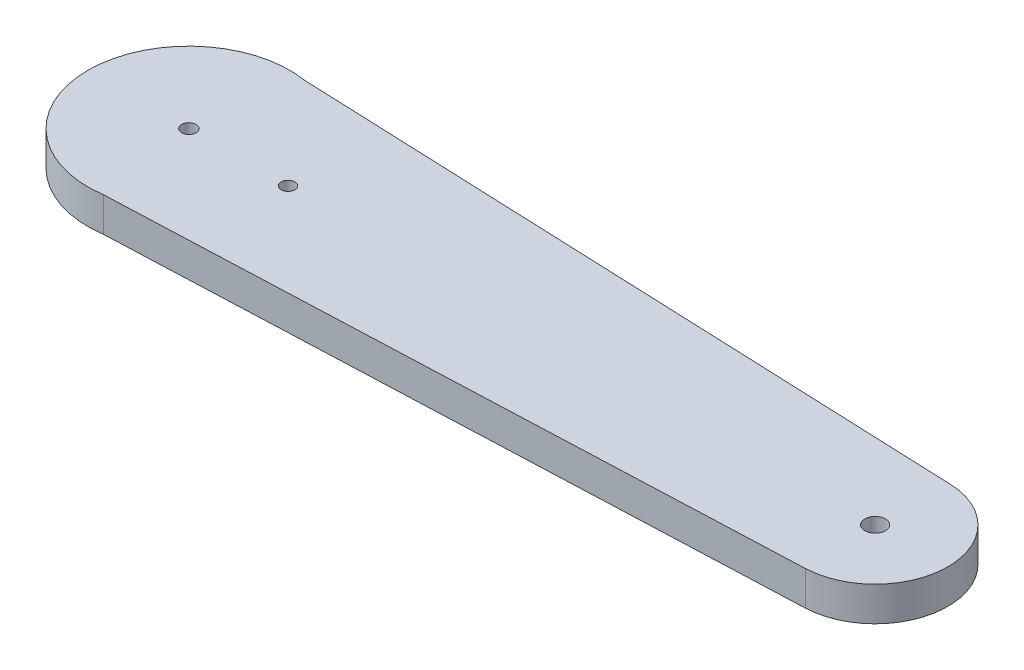
ISO-10303-21;
HEADER;
FILE_DESCRIPTION(('STEP AP214'),'2;1');
FILE_NAME('part.step','',(''),(''),'','','');
FILE_SCHEMA(('AUTOMOTIVE_DESIGN { 1 0 10303 214 1 1 1 1 }'));
ENDSEC;
DATA;
#1=APPLICATION_CONTEXT('core data for automotive mechanical design processes');
#2=APPLICATION_PROTOCOL_DEFINITION('international standard','automotive_design',2000,#1);
#3=PRODUCT_CONTEXT('',#1,'mechanical');
#4=PRODUCT('Part','Part','',(#3));
#5=PRODUCT_RELATED_PRODUCT_CATEGORY('part','',(#4));
#6=PRODUCT_DEFINITION_FORMATION('','',#4);
#7=PRODUCT_DEFINITION_CONTEXT('part definition',#1,'design');
#8=PRODUCT_DEFINITION('design','',#6,#7);
#9=PRODUCT_DEFINITION_SHAPE('','',#8);
#10=(LENGTH_UNIT() NAMED_UNIT(*) SI_UNIT(.MILLI.,.METRE.));
#11=(NAMED_UNIT(*) PLANE_ANGLE_UNIT() SI_UNIT($,.RADIAN.));
#12=(NAMED_UNIT(*) SI_UNIT($,.STERADIAN.) SOLID_ANGLE_UNIT());
#13=UNCERTAINTY_MEASURE_WITH_UNIT(LENGTH_MEASURE(1.E-05),#10,'distance_accuracy_value','');
#14=(GEOMETRIC_REPRESENTATION_CONTEXT(3) GLOBAL_UNCERTAINTY_ASSIGNED_CONTEXT((#13)) GLOBAL_UNIT_ASSIGNED_CONTEXT((#10,
#11,#12)) REPRESENTATION_CONTEXT('',''));
#15=CARTESIAN_POINT('',(0.,0.,0.));
#16=DIRECTION('',(0.,0.,1.));
#17=DIRECTION('',(1.,0.,0.));
#18=AXIS2_PLACEMENT_3D('',#15,#16,#17);
#19=CARTESIAN_POINT('',(-52.7218919539476,5.,0.));
#20=DIRECTION('',(0.,1.,0.));
#21=DIRECTION('',(0.,0.,1.));
#22=AXIS2_PLACEMENT_3D('',#19,#20,#21);
#23=PLANE('',#22);
#24=CARTESIAN_POINT('',(-38.2718919539476,5.,0.));
#25=DIRECTION('',(0.,1.,0.));
#26=DIRECTION('',(0.,0.,1.));
#27=AXIS2_PLACEMENT_3D('',#24,#25,#26);
#28=CIRCLE('',#27,0.999999999999998);
#29=CARTESIAN_POINT('',(-38.2718919539476,5.,0.999999999999998));
#30=VERTEX_POINT('',#29);
#31=EDGE_CURVE('E144',#30,#30,#28,.T.);
#32=ORIENTED_EDGE('',*,*,#31,.F.);
#33=EDGE_LOOP('',(#32));
#34=FACE_BOUND('',#33,.T.);
#35=CARTESIAN_POINT('',(-52.7218919539476,5.,0.));
#36=DIRECTION('',(0.,1.,0.));
#37=DIRECTION('',(0.,0.,1.));
#38=AXIS2_PLACEMENT_3D('',#35,#36,#37);
#39=CIRCLE('',#38,1.05);
#40=CARTESIAN_POINT('',(-52.7218919539476,5.,1.05));
#41=VERTEX_POINT('',#40);
#42=EDGE_CURVE('E114',#41,#41,#39,.T.);
#43=ORIENTED_EDGE('',*,*,#42,.F.);
#44=EDGE_LOOP('',(#43));
#45=FACE_BOUND('',#44,.T.);
#46=CARTESIAN_POINT('',(-52.7218919539476,5.,0.));
#47=DIRECTION('',(0.,1.,0.));
#48=DIRECTION('',(0.,0.,1.));
#49=AXIS2_PLACEMENT_3D('',#46,#47,#48);
#50=CIRCLE('',#49,14.72);
#51=CARTESIAN_POINT('',(-50.3488427591689,5.,-14.5274580542902));
#52=VERTEX_POINT('',#51);
#53=CARTESIAN_POINT('',(-50.5835852424027,5.,14.5638609031864));
#54=VERTEX_POINT('',#53);
#55=EDGE_CURVE('E94',#52,#54,#50,.T.);
#56=ORIENTED_EDGE('',*,*,#55,.T.);
#57=DIRECTION('',(0.999184260805067,0.,-0.0403833252646607));
#58=VECTOR('',#57,1.);
#59=CARTESIAN_POINT('',(-50.5835852424027,5.,14.5638609031864));
#60=LINE('',#59,#58);
#61=CARTESIAN_POINT('',(47.7061712938578,5.,10.5913531645337));
#62=VERTEX_POINT('',#61);
#63=EDGE_CURVE('E89',#54,#62,#60,.T.);
#64=ORIENTED_EDGE('',*,*,#63,.T.);
#65=CARTESIAN_POINT('',(47.2781080460524,5.,0.));
#66=DIRECTION('',(0.,1.,0.));
#67=DIRECTION('',(0.,0.,1.));
#68=AXIS2_PLACEMENT_3D('',#65,#66,#67);
#69=CIRCLE('',#68,10.6);
#70=CARTESIAN_POINT('',(47.6312452465184,5.,-10.594116013979));
#71=VERTEX_POINT('',#70);
#72=EDGE_CURVE('E92',#62,#71,#69,.T.);
#73=ORIENTED_EDGE('',*,*,#72,.T.);
#74=DIRECTION('',(-0.999195190213286,0.,-0.0401119914070138));
#75=VECTOR('',#74,1.);
#76=CARTESIAN_POINT('',(-50.3488427591689,5.,-14.5274580542902));
#77=LINE('',#76,#75);
#78=EDGE_CURVE('E59',#71,#52,#77,.T.);
#79=ORIENTED_EDGE('',*,*,#78,.T.);
#80=EDGE_LOOP('',(#56,#64,#73,#79));
#81=FACE_BOUND('',#80,.T.);
#82=CARTESIAN_POINT('',(47.2781080460524,5.,0.));
#83=DIRECTION('',(0.,1.,0.));
#84=DIRECTION('',(0.,0.,1.));
#85=AXIS2_PLACEMENT_3D('',#82,#83,#84);
#86=CIRCLE('',#85,1.5);
#87=CARTESIAN_POINT('',(47.2781080460524,5.,1.5));
#88=VERTEX_POINT('',#87);
#89=EDGE_CURVE('E136',#88,#88,#86,.T.);
#90=ORIENTED_EDGE('',*,*,#89,.F.);
#91=EDGE_LOOP('',(#90));
#92=FACE_BOUND('',#91,.T.);
#93=ADVANCED_FACE('F41',(#34,#45,#81,#92),#23,.T.);
#94=CARTESIAN_POINT('',(-52.7218919539476,0.,0.));
#95=DIRECTION('',(0.,1.,0.));
#96=DIRECTION('',(0.,0.,1.));
#97=AXIS2_PLACEMENT_3D('',#94,#95,#96);
#98=PLANE('',#97);
#99=CARTESIAN_POINT('',(-38.2718919539476,0.,0.));
#100=DIRECTION('',(0.,1.,0.));
#101=DIRECTION('',(0.,0.,1.));
#102=AXIS2_PLACEMENT_3D('',#99,#100,#101);
#103=CIRCLE('',#102,0.999999999999998);
#104=CARTESIAN_POINT('',(-38.2718919539476,0.,0.999999999999998));
#105=VERTEX_POINT('',#104);
#106=EDGE_CURVE('E151',#105,#105,#103,.T.);
#107=ORIENTED_EDGE('',*,*,#106,.T.);
#108=EDGE_LOOP('',(#107));
#109=FACE_BOUND('',#108,.T.);
#110=CARTESIAN_POINT('',(-52.7218919539476,0.,0.));
#111=DIRECTION('',(0.,1.,0.));
#112=DIRECTION('',(0.,0.,1.));
#113=AXIS2_PLACEMENT_3D('',#110,#111,#112);
#114=CIRCLE('',#113,14.72);
#115=CARTESIAN_POINT('',(-50.3488427591689,0.,-14.5274580542902));
#116=VERTEX_POINT('',#115);
#117=CARTESIAN_POINT('',(-50.5835852424027,0.,14.5638609031864));
#118=VERTEX_POINT('',#117);
#119=EDGE_CURVE('E110',#116,#118,#114,.T.);
#120=ORIENTED_EDGE('',*,*,#119,.F.);
#121=DIRECTION('',(-0.999195190213286,0.,-0.0401119914070138));
#122=VECTOR('',#121,1.);
#123=CARTESIAN_POINT('',(-50.3488427591689,0.,-14.5274580542902));
#124=LINE('',#123,#122);
#125=CARTESIAN_POINT('',(47.6312452465184,0.,-10.594116013979));
#126=VERTEX_POINT('',#125);
#127=EDGE_CURVE('E82',#126,#116,#124,.T.);
#128=ORIENTED_EDGE('',*,*,#127,.F.);
#129=CARTESIAN_POINT('',(47.2781080460524,0.,0.));
#130=DIRECTION('',(0.,1.,0.));
#131=DIRECTION('',(0.,0.,1.));
#132=AXIS2_PLACEMENT_3D('',#129,#130,#131);
#133=CIRCLE('',#132,10.6);
#134=CARTESIAN_POINT('',(47.7061712938578,0.,10.5913531645337));
#135=VERTEX_POINT('',#134);
#136=EDGE_CURVE('E76',#135,#126,#133,.T.);
#137=ORIENTED_EDGE('',*,*,#136,.F.);
#138=DIRECTION('',(0.999184260805067,0.,-0.0403833252646607));
#139=VECTOR('',#138,1.);
#140=CARTESIAN_POINT('',(-50.5835852424027,0.,14.5638609031864));
#141=LINE('',#140,#139);
#142=EDGE_CURVE('E99',#118,#135,#141,.T.);
#143=ORIENTED_EDGE('',*,*,#142,.F.);
#144=EDGE_LOOP('',(#120,#128,#137,#143));
#145=FACE_BOUND('',#144,.T.);
#146=CARTESIAN_POINT('',(-52.7218919539476,0.,0.));
#147=DIRECTION('',(0.,1.,0.));
#148=DIRECTION('',(0.,0.,1.));
#149=AXIS2_PLACEMENT_3D('',#146,#147,#148);
#150=CIRCLE('',#149,1.05);
#151=CARTESIAN_POINT('',(-52.7218919539476,0.,1.05));
#152=VERTEX_POINT('',#151);
#153=EDGE_CURVE('E132',#152,#152,#150,.T.);
#154=ORIENTED_EDGE('',*,*,#153,.T.);
#155=EDGE_LOOP('',(#154));
#156=FACE_BOUND('',#155,.T.);
#157=CARTESIAN_POINT('',(47.2781080460524,0.,0.));
#158=DIRECTION('',(0.,1.,0.));
#159=DIRECTION('',(0.,0.,1.));
#160=AXIS2_PLACEMENT_3D('',#157,#158,#159);
#161=CIRCLE('',#160,1.5);
#162=CARTESIAN_POINT('',(47.2781080460524,0.,1.5));
#163=VERTEX_POINT('',#162);
#164=EDGE_CURVE('E140',#163,#163,#161,.T.);
#165=ORIENTED_EDGE('',*,*,#164,.T.);
#166=EDGE_LOOP('',(#165));
#167=FACE_BOUND('',#166,.T.);
#168=ADVANCED_FACE('F127',(#109,#145,#156,#167),#98,.F.);
#169=CARTESIAN_POINT('',(-52.7218919539476,5.,0.));
#170=DIRECTION('',(0.,-1.,0.));
#171=DIRECTION('',(0.,0.,-1.));
#172=AXIS2_PLACEMENT_3D('',#169,#170,#171);
#173=CYLINDRICAL_SURFACE('',#172,14.72);
#174=ORIENTED_EDGE('',*,*,#119,.T.);
#175=DIRECTION('',(0.,-1.,0.));
#176=VECTOR('',#175,1.);
#177=CARTESIAN_POINT('',(-50.5835852424027,5.,14.5638609031864));
#178=LINE('',#177,#176);
#179=EDGE_CURVE('E11',#54,#118,#178,.T.);
#180=ORIENTED_EDGE('',*,*,#179,.F.);
#181=ORIENTED_EDGE('',*,*,#55,.F.);
#182=DIRECTION('',(0.,-1.,0.));
#183=VECTOR('',#182,1.);
#184=CARTESIAN_POINT('',(-50.3488427591689,5.,-14.5274580542902));
#185=LINE('',#184,#183);
#186=EDGE_CURVE('E106',#52,#116,#185,.T.);
#187=ORIENTED_EDGE('',*,*,#186,.T.);
#188=EDGE_LOOP('',(#174,#180,#181,#187));
#189=FACE_BOUND('',#188,.T.);
#190=ADVANCED_FACE('F43',(#189),#173,.T.);
#191=CARTESIAN_POINT('',(-50.5835852424027,5.,14.5638609031864));
#192=DIRECTION('',(-0.0403833252646607,0.,-0.999184260805067));
#193=DIRECTION('',(-0.999184260805067,0.,0.0403833252646607));
#194=AXIS2_PLACEMENT_3D('',#191,#192,#193);
#195=PLANE('',#194);
#196=ORIENTED_EDGE('',*,*,#142,.T.);
#197=DIRECTION('',(0.,-1.,0.));
#198=VECTOR('',#197,1.);
#199=CARTESIAN_POINT('',(47.7061712938578,5.,10.5913531645337));
#200=LINE('',#199,#198);
#201=EDGE_CURVE('E51',#62,#135,#200,.T.);
#202=ORIENTED_EDGE('',*,*,#201,.F.);
#203=ORIENTED_EDGE('',*,*,#63,.F.);
#204=ORIENTED_EDGE('',*,*,#179,.T.);
#205=EDGE_LOOP('',(#196,#202,#203,#204));
#206=FACE_BOUND('',#205,.T.);
#207=ADVANCED_FACE('F98',(#206),#195,.F.);
#208=CARTESIAN_POINT('',(47.2781080460524,5.,0.));
#209=DIRECTION('',(0.,-1.,0.));
#210=DIRECTION('',(0.,0.,-1.));
#211=AXIS2_PLACEMENT_3D('',#208,#209,#210);
#212=CYLINDRICAL_SURFACE('',#211,10.6);
#213=ORIENTED_EDGE('',*,*,#136,.T.);
#214=DIRECTION('',(0.,-1.,0.));
#215=VECTOR('',#214,1.);
#216=CARTESIAN_POINT('',(47.6312452465184,5.,-10.594116013979));
#217=LINE('',#216,#215);
#218=EDGE_CURVE('E101',#71,#126,#217,.T.);
#219=ORIENTED_EDGE('',*,*,#218,.F.);
#220=ORIENTED_EDGE('',*,*,#72,.F.);
#221=ORIENTED_EDGE('',*,*,#201,.T.);
#222=EDGE_LOOP('',(#213,#219,#220,#221));
#223=FACE_BOUND('',#222,.T.);
#224=ADVANCED_FACE('F102',(#223),#212,.T.);
#225=CARTESIAN_POINT('',(-50.3488427591689,5.,-14.5274580542902));
#226=DIRECTION('',(-0.0401119914070138,0.,0.999195190213286));
#227=DIRECTION('',(0.999195190213286,0.,0.0401119914070138));
#228=AXIS2_PLACEMENT_3D('',#225,#226,#227);
#229=PLANE('',#228);
#230=ORIENTED_EDGE('',*,*,#127,.T.);
#231=ORIENTED_EDGE('',*,*,#186,.F.);
#232=ORIENTED_EDGE('',*,*,#78,.F.);
#233=ORIENTED_EDGE('',*,*,#218,.T.);
#234=EDGE_LOOP('',(#230,#231,#232,#233));
#235=FACE_BOUND('',#234,.T.);
#236=ADVANCED_FACE('F124',(#235),#229,.F.);
#237=CARTESIAN_POINT('',(-52.7218919539476,5.,0.));
#238=DIRECTION('',(0.,-1.,0.));
#239=DIRECTION('',(0.,0.,-1.));
#240=AXIS2_PLACEMENT_3D('',#237,#238,#239);
#241=CYLINDRICAL_SURFACE('',#240,1.05);
#242=ORIENTED_EDGE('',*,*,#42,.T.);
#243=EDGE_LOOP('',(#242));
#244=FACE_BOUND('',#243,.T.);
#245=ORIENTED_EDGE('',*,*,#153,.F.);
#246=EDGE_LOOP('',(#245));
#247=FACE_BOUND('',#246,.T.);
#248=ADVANCED_FACE('F165',(#244,#247),#241,.F.);
#249=CARTESIAN_POINT('',(47.2781080460524,5.,0.));
#250=DIRECTION('',(0.,-1.,0.));
#251=DIRECTION('',(0.,0.,-1.));
#252=AXIS2_PLACEMENT_3D('',#249,#250,#251);
#253=CYLINDRICAL_SURFACE('',#252,1.5);
#254=ORIENTED_EDGE('',*,*,#89,.T.);
#255=EDGE_LOOP('',(#254));
#256=FACE_BOUND('',#255,.T.);
#257=ORIENTED_EDGE('',*,*,#164,.F.);
#258=EDGE_LOOP('',(#257));
#259=FACE_BOUND('',#258,.T.);
#260=ADVANCED_FACE('F159',(#256,#259),#253,.F.);
#261=CARTESIAN_POINT('',(-38.2718919539476,0.,0.));
#262=DIRECTION('',(0.,1.,0.));
#263=DIRECTION('',(0.,0.,1.));
#264=AXIS2_PLACEMENT_3D('',#261,#262,#263);
#265=CYLINDRICAL_SURFACE('',#264,0.999999999999998);
#266=ORIENTED_EDGE('',*,*,#31,.T.);
#267=EDGE_LOOP('',(#266));
#268=FACE_BOUND('',#267,.T.);
#269=ORIENTED_EDGE('',*,*,#106,.F.);
#270=EDGE_LOOP('',(#269));
#271=FACE_BOUND('',#270,.T.);
#272=ADVANCED_FACE('F157',(#268,#271),#265,.F.);
#273=CLOSED_SHELL('',(#93,#168,#190,#207,#224,#236,#248,#260,#272));
#274=MANIFOLD_SOLID_BREP('B2',#273);
#275=ADVANCED_BREP_SHAPE_REPRESENTATION('',(#18,#274),#14);
#276=SHAPE_DEFINITION_REPRESENTATION(#9,#275);
ENDSEC;
END-ISO-10303-21;
